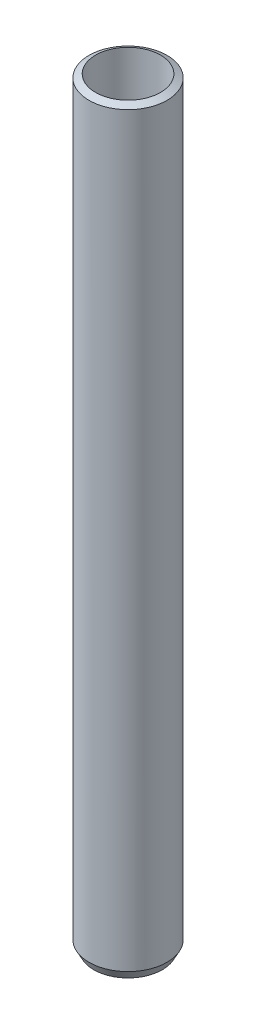
ISO-10303-21;
HEADER;
FILE_DESCRIPTION(('STEP AP214'),'2;1');
FILE_NAME('part.step','',(''),(''),'','','');
FILE_SCHEMA(('AUTOMOTIVE_DESIGN { 1 0 10303 214 1 1 1 1 }'));
ENDSEC;
DATA;
#1=APPLICATION_CONTEXT('core data for automotive mechanical design processes');
#2=APPLICATION_PROTOCOL_DEFINITION('international standard','automotive_design',2000,#1);
#3=PRODUCT_CONTEXT('',#1,'mechanical');
#4=PRODUCT('Part','Part','',(#3));
#5=PRODUCT_RELATED_PRODUCT_CATEGORY('part','',(#4));
#6=PRODUCT_DEFINITION_FORMATION('','',#4);
#7=PRODUCT_DEFINITION_CONTEXT('part definition',#1,'design');
#8=PRODUCT_DEFINITION('design','',#6,#7);
#9=PRODUCT_DEFINITION_SHAPE('','',#8);
#10=(LENGTH_UNIT() NAMED_UNIT(*) SI_UNIT(.MILLI.,.METRE.));
#11=(NAMED_UNIT(*) PLANE_ANGLE_UNIT() SI_UNIT($,.RADIAN.));
#12=(NAMED_UNIT(*) SI_UNIT($,.STERADIAN.) SOLID_ANGLE_UNIT());
#13=UNCERTAINTY_MEASURE_WITH_UNIT(LENGTH_MEASURE(1.E-05),#10,'distance_accuracy_value','');
#14=(GEOMETRIC_REPRESENTATION_CONTEXT(3) GLOBAL_UNCERTAINTY_ASSIGNED_CONTEXT((#13)) GLOBAL_UNIT_ASSIGNED_CONTEXT((#10,
#11,#12)) REPRESENTATION_CONTEXT('',''));
#15=CARTESIAN_POINT('',(0.,0.,0.));
#16=DIRECTION('',(0.,0.,1.));
#17=DIRECTION('',(1.,0.,0.));
#18=AXIS2_PLACEMENT_3D('',#15,#16,#17);
#19=CARTESIAN_POINT('',(0.,584.32590417291,0.));
#20=DIRECTION('',(0.,-1.,0.));
#21=DIRECTION('',(0.,0.,-1.));
#22=AXIS2_PLACEMENT_3D('',#19,#20,#21);
#23=CYLINDRICAL_SURFACE('',#22,30.);
#24=CARTESIAN_POINT('',(0.,580.671748440093,0.));
#25=DIRECTION('',(0.,1.,0.));
#26=DIRECTION('',(0.,0.,1.));
#27=AXIS2_PLACEMENT_3D('',#24,#25,#26);
#28=CIRCLE('',#27,30.);
#29=CARTESIAN_POINT('',(0.,580.671748440093,-30.0000000000001));
#30=VERTEX_POINT('',#29);
#31=EDGE_CURVE('E50',#30,#30,#28,.F.);
#32=ORIENTED_EDGE('',*,*,#31,.T.);
#33=EDGE_LOOP('',(#32));
#34=FACE_BOUND('',#33,.T.);
#35=CARTESIAN_POINT('',(0.,6.83808392474261,0.));
#36=DIRECTION('',(0.,1.,0.));
#37=DIRECTION('',(0.,0.,1.));
#38=AXIS2_PLACEMENT_3D('',#35,#36,#37);
#39=CIRCLE('',#38,30.);
#40=CARTESIAN_POINT('',(0.,6.83808392474261,30.));
#41=VERTEX_POINT('',#40);
#42=EDGE_CURVE('E51',#41,#41,#39,.T.);
#43=ORIENTED_EDGE('',*,*,#42,.T.);
#44=EDGE_LOOP('',(#43));
#45=FACE_BOUND('',#44,.T.);
#46=ADVANCED_FACE('F39',(#34,#45),#23,.T.);
#47=CARTESIAN_POINT('',(0.,0.,0.));
#48=DIRECTION('',(0.,1.,0.));
#49=DIRECTION('',(0.,0.,1.));
#50=AXIS2_PLACEMENT_3D('',#47,#48,#49);
#51=PLANE('',#50);
#52=CARTESIAN_POINT('',(0.,0.,0.));
#53=DIRECTION('',(0.,1.,0.));
#54=DIRECTION('',(0.,0.,1.));
#55=AXIS2_PLACEMENT_3D('',#52,#53,#54);
#56=CIRCLE('',#55,26.3458442671832);
#57=CARTESIAN_POINT('',(0.,0.,26.3458442671832));
#58=VERTEX_POINT('',#57);
#59=EDGE_CURVE('E10',#58,#58,#56,.F.);
#60=ORIENTED_EDGE('',*,*,#59,.T.);
#61=EDGE_LOOP('',(#60));
#62=FACE_BOUND('',#61,.T.);
#63=CARTESIAN_POINT('',(0.,0.,0.));
#64=DIRECTION('',(0.,1.,0.));
#65=DIRECTION('',(0.,0.,1.));
#66=AXIS2_PLACEMENT_3D('',#63,#64,#65);
#67=CIRCLE('',#66,24.932403849199);
#68=CARTESIAN_POINT('',(0.,0.,24.932403849199));
#69=VERTEX_POINT('',#68);
#70=EDGE_CURVE('E58',#69,#69,#67,.T.);
#71=ORIENTED_EDGE('',*,*,#70,.T.);
#72=EDGE_LOOP('',(#71));
#73=FACE_BOUND('',#72,.T.);
#74=ADVANCED_FACE('F62',(#62,#73),#51,.F.);
#75=CARTESIAN_POINT('',(0.,584.32590417291,0.));
#76=DIRECTION('',(0.,-1.,0.));
#77=DIRECTION('',(0.,0.,-1.));
#78=AXIS2_PLACEMENT_3D('',#75,#76,#77);
#79=CYLINDRICAL_SURFACE('',#78,24.932403849199);
#80=CARTESIAN_POINT('',(0.,583.379785622709,0.));
#81=DIRECTION('',(0.,-1.,0.));
#82=DIRECTION('',(0.,0.,-1.));
#83=AXIS2_PLACEMENT_3D('',#80,#81,#82);
#84=CIRCLE('',#83,24.932403849199);
#85=CARTESIAN_POINT('',(0.,583.379785622709,-24.9324038491988));
#86=VERTEX_POINT('',#85);
#87=EDGE_CURVE('E54',#86,#86,#84,.F.);
#88=ORIENTED_EDGE('',*,*,#87,.T.);
#89=EDGE_LOOP('',(#88));
#90=FACE_BOUND('',#89,.T.);
#91=ORIENTED_EDGE('',*,*,#70,.F.);
#92=EDGE_LOOP('',(#91));
#93=FACE_BOUND('',#92,.T.);
#94=ADVANCED_FACE('F68',(#90,#93),#79,.F.);
#95=CARTESIAN_POINT('',(0.,584.32590417291,0.));
#96=DIRECTION('',(0.,-1.,0.));
#97=DIRECTION('',(0.,0.,-1.));
#98=AXIS2_PLACEMENT_3D('',#95,#96,#97);
#99=CONICAL_SURFACE('',#98,23.1619160752571,1.08002215008084);
#100=CARTESIAN_POINT('',(0.,580.671748440093,-30.0000000000001));
#101=CARTESIAN_POINT('',(0.,580.699957160745,-29.9472125400959));
#102=CARTESIAN_POINT('',(0.,580.728165881398,-29.8944250801917));
#103=CARTESIAN_POINT('',(0.,580.784583322702,-29.7888501603834));
#104=CARTESIAN_POINT('',(0.,580.812792043354,-29.7360627004792));
#105=CARTESIAN_POINT('',(0.,580.869209484659,-29.6304877806708));
#106=CARTESIAN_POINT('',(0.,580.897418205311,-29.5777003207667));
#107=CARTESIAN_POINT('',(0.,580.953835646616,-29.4721254009583));
#108=CARTESIAN_POINT('',(0.,580.982044367268,-29.4193379410541));
#109=CARTESIAN_POINT('',(0.,581.038461808572,-29.3137630212458));
#110=CARTESIAN_POINT('',(0.,581.066670529225,-29.2609755613416));
#111=CARTESIAN_POINT('',(0.,581.123087970529,-29.1554006415332));
#112=CARTESIAN_POINT('',(0.,581.151296691181,-29.102613181629));
#113=CARTESIAN_POINT('',(0.,581.207714132486,-28.9970382618207));
#114=CARTESIAN_POINT('',(0.,581.235922853138,-28.9442508019165));
#115=CARTESIAN_POINT('',(0.,581.292340294442,-28.8386758821081));
#116=CARTESIAN_POINT('',(0.,581.320549015095,-28.785888422204));
#117=CARTESIAN_POINT('',(0.,581.376966456399,-28.6803135023956));
#118=CARTESIAN_POINT('',(0.,581.405175177051,-28.6275260424914));
#119=CARTESIAN_POINT('',(0.,581.461592618356,-28.521951122683));
#120=CARTESIAN_POINT('',(0.,581.489801339008,-28.4691636627789));
#121=CARTESIAN_POINT('',(0.,581.546218780313,-28.3635887429705));
#122=CARTESIAN_POINT('',(0.,581.574427500965,-28.3108012830663));
#123=CARTESIAN_POINT('',(0.,581.63084494227,-28.205226363258));
#124=CARTESIAN_POINT('',(0.,581.659053662922,-28.1524389033538));
#125=CARTESIAN_POINT('',(0.,581.715471104226,-28.0468639835454));
#126=CARTESIAN_POINT('',(0.,581.743679824879,-27.9940765236413));
#127=CARTESIAN_POINT('',(0.,581.800097266183,-27.8885016038329));
#128=CARTESIAN_POINT('',(0.,581.828305986835,-27.8357141439287));
#129=CARTESIAN_POINT('',(0.,581.88472342814,-27.7301392241203));
#130=CARTESIAN_POINT('',(0.,581.912932148792,-27.6773517642162));
#131=CARTESIAN_POINT('',(0.,581.969349590096,-27.5717768444078));
#132=CARTESIAN_POINT('',(0.,581.997558310749,-27.5189893845036));
#133=CARTESIAN_POINT('',(0.,582.053975752053,-27.4134144646953));
#134=CARTESIAN_POINT('',(0.,582.082184472705,-27.3606270047911));
#135=CARTESIAN_POINT('',(0.,582.13860191401,-27.2550520849827));
#136=CARTESIAN_POINT('',(0.,582.166810634662,-27.2022646250786));
#137=CARTESIAN_POINT('',(0.,582.223228075967,-27.0966897052702));
#138=CARTESIAN_POINT('',(0.,582.251436796619,-27.043902245366));
#139=CARTESIAN_POINT('',(0.,582.307854237923,-26.9383273255576));
#140=CARTESIAN_POINT('',(0.,582.336062958576,-26.8855398656535));
#141=CARTESIAN_POINT('',(0.,582.39248039988,-26.7799649458451));
#142=CARTESIAN_POINT('',(0.,582.420689120532,-26.7271774859409));
#143=CARTESIAN_POINT('',(0.,582.477106561837,-26.6216025661326));
#144=CARTESIAN_POINT('',(0.,582.505315282489,-26.5688151062284));
#145=CARTESIAN_POINT('',(0.,582.561732723794,-26.46324018642));
#146=CARTESIAN_POINT('',(0.,582.589941444446,-26.4104527265159));
#147=CARTESIAN_POINT('',(0.,582.64635888575,-26.3048778067075));
#148=CARTESIAN_POINT('',(0.,582.674567606403,-26.2520903468033));
#149=CARTESIAN_POINT('',(0.,582.730985047707,-26.1465154269949));
#150=CARTESIAN_POINT('',(0.,582.75919376836,-26.0937279670908));
#151=CARTESIAN_POINT('',(0.,582.815611209664,-25.9881530472824));
#152=CARTESIAN_POINT('',(0.,582.843819930316,-25.9353655873782));
#153=CARTESIAN_POINT('',(0.,582.900237371621,-25.8297906675699));
#154=CARTESIAN_POINT('',(0.,582.928446092273,-25.7770032076657));
#155=CARTESIAN_POINT('',(0.,582.984863533577,-25.6714282878573));
#156=CARTESIAN_POINT('',(0.,583.01307225423,-25.6186408279532));
#157=CARTESIAN_POINT('',(0.,583.069489695534,-25.5130659081448));
#158=CARTESIAN_POINT('',(0.,583.097698416186,-25.4602784482406));
#159=CARTESIAN_POINT('',(0.,583.154115857491,-25.3547035284322));
#160=CARTESIAN_POINT('',(0.,583.182324578143,-25.3019160685281));
#161=CARTESIAN_POINT('',(0.,583.238742019448,-25.1963411487197));
#162=CARTESIAN_POINT('',(0.,583.2669507401,-25.1435536888155));
#163=CARTESIAN_POINT('',(0.,583.323368181404,-25.0379787690072));
#164=CARTESIAN_POINT('',(0.,583.351576902057,-24.985191309103));
#165=CARTESIAN_POINT('',(0.,583.379785622709,-24.9324038491988));
#166=B_SPLINE_CURVE_WITH_KNOTS('',3,(#100,#101,#102,#103,#104,#105,#106,#107,#108,#109,#110,
#111,#112,#113,#114,#115,#116,#117,#118,#119,#120,#121,#122,#123,#124,#125,#126,#127,#128,#129,
#130,#131,#132,#133,#134,#135,#136,#137,#138,#139,#140,#141,#142,#143,#144,#145,#146,#147,#148,
#149,#150,#151,#152,#153,#154,#155,#156,#157,#158,#159,#160,#161,#162,#163,#164,#165),
.UNSPECIFIED.,.F.,.F.,(4,2,2,2,2,2,2,2,2,2,2,2,2,2,2,2,2,2,2,2,2,2,2,2,2,2,2,2,2,2,2,2,4),(0.,
0.179555647629756,0.359111295259512,0.538666942889321,0.718222590519074,0.897778238148882,
1.07733388577864,1.25688953340839,1.4364451810382,1.61600082866796,1.79555647629776,
1.97511212392752,2.15466777155728,2.33422341918708,2.51377906681684,2.69333471444665,
2.8728903620764,3.05244600970616,3.23200165733596,3.41155730496572,3.59111295259553,
3.77066860022529,3.95022424785504,4.12977989548485,4.3093355431146,4.48889119074441,
4.66844683837417,4.84800248600392,5.02755813363373,5.20711378126349,5.3866694288933,
5.56622507652305,5.74578072415286),.UNSPECIFIED.);
#167=EDGE_CURVE('BSEAM66',#30,#86,#166,.T.);
#168=ORIENTED_EDGE('',*,*,#31,.F.);
#169=ORIENTED_EDGE('',*,*,#87,.F.);
#170=ORIENTED_EDGE('',*,*,#167,.T.);
#171=ORIENTED_EDGE('',*,*,#167,.F.);
#172=EDGE_LOOP('',(#168,#170,#169,#171));
#173=FACE_BOUND('',#172,.T.);
#174=ADVANCED_FACE('F66',(#173),#99,.T.);
#175=CARTESIAN_POINT('',(0.,6.83808392474261,0.));
#176=DIRECTION('',(0.,1.,0.));
#177=DIRECTION('',(0.,0.,1.));
#178=AXIS2_PLACEMENT_3D('',#175,#176,#177);
#179=CONICAL_SURFACE('',#178,30.,0.490774176714058);
#180=ORIENTED_EDGE('',*,*,#59,.F.);
#181=EDGE_LOOP('',(#180));
#182=FACE_BOUND('',#181,.T.);
#183=ORIENTED_EDGE('',*,*,#42,.F.);
#184=EDGE_LOOP('',(#183));
#185=FACE_BOUND('',#184,.T.);
#186=ADVANCED_FACE('F45',(#182,#185),#179,.T.);
#187=CLOSED_SHELL('',(#46,#74,#94,#174,#186));
#188=MANIFOLD_SOLID_BREP('B2',#187);
#189=ADVANCED_BREP_SHAPE_REPRESENTATION('',(#18,#188),#14);
#190=SHAPE_DEFINITION_REPRESENTATION(#9,#189);
ENDSEC;
END-ISO-10303-21;
